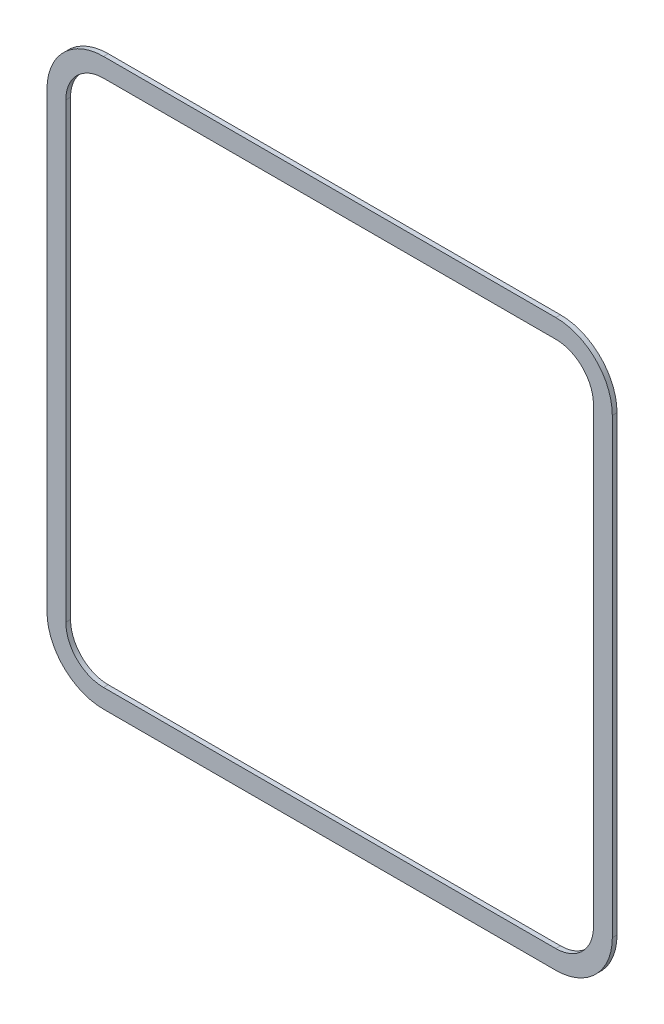
ISO-10303-21;
HEADER;
FILE_DESCRIPTION(('STEP AP214'),'2;1');
FILE_NAME('part.step','',(''),(''),'','','');
FILE_SCHEMA(('AUTOMOTIVE_DESIGN { 1 0 10303 214 1 1 1 1 }'));
ENDSEC;
DATA;
#1=APPLICATION_CONTEXT('core data for automotive mechanical design processes');
#2=APPLICATION_PROTOCOL_DEFINITION('international standard','automotive_design',2000,#1);
#3=PRODUCT_CONTEXT('',#1,'mechanical');
#4=PRODUCT('Part','Part','',(#3));
#5=PRODUCT_RELATED_PRODUCT_CATEGORY('part','',(#4));
#6=PRODUCT_DEFINITION_FORMATION('','',#4);
#7=PRODUCT_DEFINITION_CONTEXT('part definition',#1,'design');
#8=PRODUCT_DEFINITION('design','',#6,#7);
#9=PRODUCT_DEFINITION_SHAPE('','',#8);
#10=(LENGTH_UNIT() NAMED_UNIT(*) SI_UNIT(.MILLI.,.METRE.));
#11=(NAMED_UNIT(*) PLANE_ANGLE_UNIT() SI_UNIT($,.RADIAN.));
#12=(NAMED_UNIT(*) SI_UNIT($,.STERADIAN.) SOLID_ANGLE_UNIT());
#13=UNCERTAINTY_MEASURE_WITH_UNIT(LENGTH_MEASURE(1.E-05),#10,'distance_accuracy_value','');
#14=(GEOMETRIC_REPRESENTATION_CONTEXT(3) GLOBAL_UNCERTAINTY_ASSIGNED_CONTEXT((#13)) GLOBAL_UNIT_ASSIGNED_CONTEXT((#10,
#11,#12)) REPRESENTATION_CONTEXT('',''));
#15=CARTESIAN_POINT('',(0.,0.,0.));
#16=DIRECTION('',(0.,0.,1.));
#17=DIRECTION('',(1.,0.,0.));
#18=AXIS2_PLACEMENT_3D('',#15,#16,#17);
#19=CARTESIAN_POINT('',(28.,0.,0.5));
#20=DIRECTION('',(1.,0.,0.));
#21=DIRECTION('',(0.,0.,-1.));
#22=AXIS2_PLACEMENT_3D('',#19,#20,#21);
#23=PLANE('',#22);
#24=DIRECTION('',(0.,-1.,0.));
#25=VECTOR('',#24,1.);
#26=CARTESIAN_POINT('',(28.,0.,0.));
#27=LINE('',#26,#25);
#28=CARTESIAN_POINT('',(28.,24.,0.));
#29=VERTEX_POINT('',#28);
#30=CARTESIAN_POINT('',(28.,-24.,0.));
#31=VERTEX_POINT('',#30);
#32=EDGE_CURVE('E230',#29,#31,#27,.T.);
#33=ORIENTED_EDGE('',*,*,#32,.T.);
#34=DIRECTION('',(0.,0.,-1.));
#35=VECTOR('',#34,1.);
#36=CARTESIAN_POINT('',(28.,-24.,0.5));
#37=LINE('',#36,#35);
#38=CARTESIAN_POINT('',(28.,-24.,0.5));
#39=VERTEX_POINT('',#38);
#40=EDGE_CURVE('E11',#39,#31,#37,.T.);
#41=ORIENTED_EDGE('',*,*,#40,.F.);
#42=DIRECTION('',(0.,-1.,0.));
#43=VECTOR('',#42,1.);
#44=CARTESIAN_POINT('',(28.,0.,0.5));
#45=LINE('',#44,#43);
#46=CARTESIAN_POINT('',(28.,24.,0.5));
#47=VERTEX_POINT('',#46);
#48=EDGE_CURVE('E338',#47,#39,#45,.T.);
#49=ORIENTED_EDGE('',*,*,#48,.F.);
#50=DIRECTION('',(0.,0.,-1.));
#51=VECTOR('',#50,1.);
#52=CARTESIAN_POINT('',(28.,24.,0.5));
#53=LINE('',#52,#51);
#54=EDGE_CURVE('E257',#47,#29,#53,.T.);
#55=ORIENTED_EDGE('',*,*,#54,.T.);
#56=EDGE_LOOP('',(#33,#41,#49,#55));
#57=FACE_BOUND('',#56,.T.);
#58=ADVANCED_FACE('F45',(#57),#23,.F.);
#59=CARTESIAN_POINT('',(24.,-24.,0.5));
#60=DIRECTION('',(0.,0.,-1.));
#61=DIRECTION('',(-1.,0.,0.));
#62=AXIS2_PLACEMENT_3D('',#59,#60,#61);
#63=CYLINDRICAL_SURFACE('',#62,3.99999999999999);
#64=CARTESIAN_POINT('',(24.,-24.,0.));
#65=DIRECTION('',(0.,0.,1.));
#66=DIRECTION('',(1.,0.,0.));
#67=AXIS2_PLACEMENT_3D('',#64,#65,#66);
#68=CIRCLE('',#67,3.99999999999999);
#69=CARTESIAN_POINT('',(24.,-28.,0.));
#70=VERTEX_POINT('',#69);
#71=EDGE_CURVE('E234',#31,#70,#68,.F.);
#72=ORIENTED_EDGE('',*,*,#71,.T.);
#73=DIRECTION('',(0.,0.,-1.));
#74=VECTOR('',#73,1.);
#75=CARTESIAN_POINT('',(24.,-28.,0.5));
#76=LINE('',#75,#74);
#77=CARTESIAN_POINT('',(24.,-28.,0.5));
#78=VERTEX_POINT('',#77);
#79=EDGE_CURVE('E56',#78,#70,#76,.T.);
#80=ORIENTED_EDGE('',*,*,#79,.F.);
#81=CARTESIAN_POINT('',(24.,-24.,0.5));
#82=DIRECTION('',(0.,0.,1.));
#83=DIRECTION('',(1.,0.,0.));
#84=AXIS2_PLACEMENT_3D('',#81,#82,#83);
#85=CIRCLE('',#84,3.99999999999999);
#86=EDGE_CURVE('E341',#39,#78,#85,.F.);
#87=ORIENTED_EDGE('',*,*,#86,.F.);
#88=ORIENTED_EDGE('',*,*,#40,.T.);
#89=EDGE_LOOP('',(#72,#80,#87,#88));
#90=FACE_BOUND('',#89,.T.);
#91=ADVANCED_FACE('F376',(#90),#63,.F.);
#92=CARTESIAN_POINT('',(0.,-28.,0.5));
#93=DIRECTION('',(0.,1.,0.));
#94=DIRECTION('',(-1.,0.,0.));
#95=AXIS2_PLACEMENT_3D('',#92,#93,#94);
#96=PLANE('',#95);
#97=DIRECTION('',(1.,0.,0.));
#98=VECTOR('',#97,1.);
#99=CARTESIAN_POINT('',(0.,-28.,0.));
#100=LINE('',#99,#98);
#101=CARTESIAN_POINT('',(-24.,-28.,0.));
#102=VERTEX_POINT('',#101);
#103=EDGE_CURVE('E238',#102,#70,#100,.T.);
#104=ORIENTED_EDGE('',*,*,#103,.F.);
#105=DIRECTION('',(0.,0.,-1.));
#106=VECTOR('',#105,1.);
#107=CARTESIAN_POINT('',(-24.,-28.,0.5));
#108=LINE('',#107,#106);
#109=CARTESIAN_POINT('',(-24.,-28.,0.5));
#110=VERTEX_POINT('',#109);
#111=EDGE_CURVE('E267',#110,#102,#108,.T.);
#112=ORIENTED_EDGE('',*,*,#111,.F.);
#113=DIRECTION('',(1.,0.,0.));
#114=VECTOR('',#113,1.);
#115=CARTESIAN_POINT('',(0.,-28.,0.5));
#116=LINE('',#115,#114);
#117=EDGE_CURVE('E344',#110,#78,#116,.T.);
#118=ORIENTED_EDGE('',*,*,#117,.T.);
#119=ORIENTED_EDGE('',*,*,#79,.T.);
#120=EDGE_LOOP('',(#104,#112,#118,#119));
#121=FACE_BOUND('',#120,.T.);
#122=ADVANCED_FACE('F381',(#121),#96,.T.);
#123=CARTESIAN_POINT('',(-24.,-24.,0.5));
#124=DIRECTION('',(0.,0.,-1.));
#125=DIRECTION('',(-1.,0.,0.));
#126=AXIS2_PLACEMENT_3D('',#123,#124,#125);
#127=CYLINDRICAL_SURFACE('',#126,4.);
#128=CARTESIAN_POINT('',(-24.,-24.,0.));
#129=DIRECTION('',(0.,0.,1.));
#130=DIRECTION('',(1.,0.,0.));
#131=AXIS2_PLACEMENT_3D('',#128,#129,#130);
#132=CIRCLE('',#131,4.);
#133=CARTESIAN_POINT('',(-28.,-24.,0.));
#134=VERTEX_POINT('',#133);
#135=EDGE_CURVE('E242',#134,#102,#132,.T.);
#136=ORIENTED_EDGE('',*,*,#135,.F.);
#137=DIRECTION('',(0.,0.,-1.));
#138=VECTOR('',#137,1.);
#139=CARTESIAN_POINT('',(-28.,-24.,0.5));
#140=LINE('',#139,#138);
#141=CARTESIAN_POINT('',(-28.,-24.,0.5));
#142=VERTEX_POINT('',#141);
#143=EDGE_CURVE('E264',#142,#134,#140,.T.);
#144=ORIENTED_EDGE('',*,*,#143,.F.);
#145=CARTESIAN_POINT('',(-24.,-24.,0.5));
#146=DIRECTION('',(0.,0.,1.));
#147=DIRECTION('',(1.,0.,0.));
#148=AXIS2_PLACEMENT_3D('',#145,#146,#147);
#149=CIRCLE('',#148,4.);
#150=EDGE_CURVE('E194',#142,#110,#149,.T.);
#151=ORIENTED_EDGE('',*,*,#150,.T.);
#152=ORIENTED_EDGE('',*,*,#111,.T.);
#153=EDGE_LOOP('',(#136,#144,#151,#152));
#154=FACE_BOUND('',#153,.T.);
#155=ADVANCED_FACE('F351',(#154),#127,.F.);
#156=CARTESIAN_POINT('',(-28.,0.,0.5));
#157=DIRECTION('',(1.,0.,0.));
#158=DIRECTION('',(0.,0.,-1.));
#159=AXIS2_PLACEMENT_3D('',#156,#157,#158);
#160=PLANE('',#159);
#161=DIRECTION('',(0.,-1.,0.));
#162=VECTOR('',#161,1.);
#163=CARTESIAN_POINT('',(-28.,0.,0.));
#164=LINE('',#163,#162);
#165=CARTESIAN_POINT('',(-28.,24.,0.));
#166=VERTEX_POINT('',#165);
#167=EDGE_CURVE('E246',#166,#134,#164,.T.);
#168=ORIENTED_EDGE('',*,*,#167,.F.);
#169=DIRECTION('',(0.,0.,-1.));
#170=VECTOR('',#169,1.);
#171=CARTESIAN_POINT('',(-28.,24.,0.5));
#172=LINE('',#171,#170);
#173=CARTESIAN_POINT('',(-28.,24.,0.5));
#174=VERTEX_POINT('',#173);
#175=EDGE_CURVE('E179',#174,#166,#172,.T.);
#176=ORIENTED_EDGE('',*,*,#175,.F.);
#177=DIRECTION('',(0.,-1.,0.));
#178=VECTOR('',#177,1.);
#179=CARTESIAN_POINT('',(-28.,0.,0.5));
#180=LINE('',#179,#178);
#181=EDGE_CURVE('E190',#174,#142,#180,.T.);
#182=ORIENTED_EDGE('',*,*,#181,.T.);
#183=ORIENTED_EDGE('',*,*,#143,.T.);
#184=EDGE_LOOP('',(#168,#176,#182,#183));
#185=FACE_BOUND('',#184,.T.);
#186=ADVANCED_FACE('F356',(#185),#160,.T.);
#187=CARTESIAN_POINT('',(-24.,24.,0.5));
#188=DIRECTION('',(0.,0.,-1.));
#189=DIRECTION('',(-1.,0.,0.));
#190=AXIS2_PLACEMENT_3D('',#187,#188,#189);
#191=CYLINDRICAL_SURFACE('',#190,4.);
#192=CARTESIAN_POINT('',(-24.,24.,0.));
#193=DIRECTION('',(0.,0.,1.));
#194=DIRECTION('',(1.,0.,0.));
#195=AXIS2_PLACEMENT_3D('',#192,#193,#194);
#196=CIRCLE('',#195,4.);
#197=CARTESIAN_POINT('',(-24.,28.,0.));
#198=VERTEX_POINT('',#197);
#199=EDGE_CURVE('E177',#198,#166,#196,.T.);
#200=ORIENTED_EDGE('',*,*,#199,.F.);
#201=DIRECTION('',(0.,0.,-1.));
#202=VECTOR('',#201,1.);
#203=CARTESIAN_POINT('',(-24.,28.,0.5));
#204=LINE('',#203,#202);
#205=CARTESIAN_POINT('',(-24.,28.,0.5));
#206=VERTEX_POINT('',#205);
#207=EDGE_CURVE('E171',#206,#198,#204,.T.);
#208=ORIENTED_EDGE('',*,*,#207,.F.);
#209=CARTESIAN_POINT('',(-24.,24.,0.5));
#210=DIRECTION('',(0.,0.,1.));
#211=DIRECTION('',(1.,0.,0.));
#212=AXIS2_PLACEMENT_3D('',#209,#210,#211);
#213=CIRCLE('',#212,4.);
#214=EDGE_CURVE('E175',#206,#174,#213,.T.);
#215=ORIENTED_EDGE('',*,*,#214,.T.);
#216=ORIENTED_EDGE('',*,*,#175,.T.);
#217=EDGE_LOOP('',(#200,#208,#215,#216));
#218=FACE_BOUND('',#217,.T.);
#219=ADVANCED_FACE('F173',(#218),#191,.F.);
#220=CARTESIAN_POINT('',(0.,28.,0.5));
#221=DIRECTION('',(0.,1.,0.));
#222=DIRECTION('',(-1.,0.,0.));
#223=AXIS2_PLACEMENT_3D('',#220,#221,#222);
#224=PLANE('',#223);
#225=DIRECTION('',(1.,0.,0.));
#226=VECTOR('',#225,1.);
#227=CARTESIAN_POINT('',(0.,28.,0.));
#228=LINE('',#227,#226);
#229=CARTESIAN_POINT('',(24.,28.,0.));
#230=VERTEX_POINT('',#229);
#231=EDGE_CURVE('E117',#198,#230,#228,.T.);
#232=ORIENTED_EDGE('',*,*,#231,.T.);
#233=DIRECTION('',(0.,0.,-1.));
#234=VECTOR('',#233,1.);
#235=CARTESIAN_POINT('',(24.,28.,0.5));
#236=LINE('',#235,#234);
#237=CARTESIAN_POINT('',(24.,28.,0.5));
#238=VERTEX_POINT('',#237);
#239=EDGE_CURVE('E180',#238,#230,#236,.T.);
#240=ORIENTED_EDGE('',*,*,#239,.F.);
#241=DIRECTION('',(1.,0.,0.));
#242=VECTOR('',#241,1.);
#243=CARTESIAN_POINT('',(0.,28.,0.5));
#244=LINE('',#243,#242);
#245=EDGE_CURVE('E182',#206,#238,#244,.T.);
#246=ORIENTED_EDGE('',*,*,#245,.F.);
#247=ORIENTED_EDGE('',*,*,#207,.T.);
#248=EDGE_LOOP('',(#232,#240,#246,#247));
#249=FACE_BOUND('',#248,.T.);
#250=ADVANCED_FACE('F183',(#249),#224,.F.);
#251=CARTESIAN_POINT('',(24.,-24.,0.5));
#252=DIRECTION('',(0.,0.,-1.));
#253=DIRECTION('',(-1.,0.,0.));
#254=AXIS2_PLACEMENT_3D('',#251,#252,#253);
#255=CYLINDRICAL_SURFACE('',#254,5.99999999999998);
#256=CARTESIAN_POINT('',(24.,-24.,0.));
#257=DIRECTION('',(0.,0.,1.));
#258=DIRECTION('',(1.,0.,0.));
#259=AXIS2_PLACEMENT_3D('',#256,#257,#258);
#260=CIRCLE('',#259,5.99999999999998);
#261=CARTESIAN_POINT('',(30.,-24.,0.));
#262=VERTEX_POINT('',#261);
#263=CARTESIAN_POINT('',(24.,-30.,0.));
#264=VERTEX_POINT('',#263);
#265=EDGE_CURVE('E201',#262,#264,#260,.F.);
#266=ORIENTED_EDGE('',*,*,#265,.F.);
#267=DIRECTION('',(0.,0.,-1.));
#268=VECTOR('',#267,1.);
#269=CARTESIAN_POINT('',(30.,-24.,0.5));
#270=LINE('',#269,#268);
#271=CARTESIAN_POINT('',(30.,-24.,0.5));
#272=VERTEX_POINT('',#271);
#273=EDGE_CURVE('E49',#272,#262,#270,.T.);
#274=ORIENTED_EDGE('',*,*,#273,.F.);
#275=CARTESIAN_POINT('',(24.,-24.,0.5));
#276=DIRECTION('',(0.,0.,1.));
#277=DIRECTION('',(1.,0.,0.));
#278=AXIS2_PLACEMENT_3D('',#275,#276,#277);
#279=CIRCLE('',#278,5.99999999999998);
#280=CARTESIAN_POINT('',(24.,-30.,0.5));
#281=VERTEX_POINT('',#280);
#282=EDGE_CURVE('E256',#272,#281,#279,.F.);
#283=ORIENTED_EDGE('',*,*,#282,.T.);
#284=DIRECTION('',(0.,0.,-1.));
#285=VECTOR('',#284,1.);
#286=CARTESIAN_POINT('',(24.,-30.,0.5));
#287=LINE('',#286,#285);
#288=EDGE_CURVE('E200',#281,#264,#287,.T.);
#289=ORIENTED_EDGE('',*,*,#288,.T.);
#290=EDGE_LOOP('',(#266,#274,#283,#289));
#291=FACE_BOUND('',#290,.T.);
#292=ADVANCED_FACE('F47',(#291),#255,.T.);
#293=CARTESIAN_POINT('',(30.,0.,0.5));
#294=DIRECTION('',(1.,0.,0.));
#295=DIRECTION('',(0.,1.,0.));
#296=AXIS2_PLACEMENT_3D('',#293,#294,#295);
#297=PLANE('',#296);
#298=DIRECTION('',(0.,-1.,0.));
#299=VECTOR('',#298,1.);
#300=CARTESIAN_POINT('',(30.,0.,0.));
#301=LINE('',#300,#299);
#302=CARTESIAN_POINT('',(30.,24.,0.));
#303=VERTEX_POINT('',#302);
#304=EDGE_CURVE('E205',#303,#262,#301,.T.);
#305=ORIENTED_EDGE('',*,*,#304,.F.);
#306=DIRECTION('',(0.,0.,-1.));
#307=VECTOR('',#306,1.);
#308=CARTESIAN_POINT('',(30.,24.,0.5));
#309=LINE('',#308,#307);
#310=CARTESIAN_POINT('',(30.,24.,0.5));
#311=VERTEX_POINT('',#310);
#312=EDGE_CURVE('E291',#311,#303,#309,.T.);
#313=ORIENTED_EDGE('',*,*,#312,.F.);
#314=DIRECTION('',(0.,-1.,0.));
#315=VECTOR('',#314,1.);
#316=CARTESIAN_POINT('',(30.,0.,0.5));
#317=LINE('',#316,#315);
#318=EDGE_CURVE('E302',#311,#272,#317,.T.);
#319=ORIENTED_EDGE('',*,*,#318,.T.);
#320=ORIENTED_EDGE('',*,*,#273,.T.);
#321=EDGE_LOOP('',(#305,#313,#319,#320));
#322=FACE_BOUND('',#321,.T.);
#323=ADVANCED_FACE('F300',(#322),#297,.T.);
#324=CARTESIAN_POINT('',(24.,24.,0.5));
#325=DIRECTION('',(0.,0.,-1.));
#326=DIRECTION('',(-1.,0.,0.));
#327=AXIS2_PLACEMENT_3D('',#324,#325,#326);
#328=CYLINDRICAL_SURFACE('',#327,6.);
#329=CARTESIAN_POINT('',(24.,24.,0.));
#330=DIRECTION('',(0.,0.,1.));
#331=DIRECTION('',(1.,0.,0.));
#332=AXIS2_PLACEMENT_3D('',#329,#330,#331);
#333=CIRCLE('',#332,6.);
#334=CARTESIAN_POINT('',(24.,30.,0.));
#335=VERTEX_POINT('',#334);
#336=EDGE_CURVE('E209',#335,#303,#333,.F.);
#337=ORIENTED_EDGE('',*,*,#336,.F.);
#338=DIRECTION('',(0.,0.,-1.));
#339=VECTOR('',#338,1.);
#340=CARTESIAN_POINT('',(24.,30.,0.5));
#341=LINE('',#340,#339);
#342=CARTESIAN_POINT('',(24.,30.,0.5));
#343=VERTEX_POINT('',#342);
#344=EDGE_CURVE('E289',#343,#335,#341,.T.);
#345=ORIENTED_EDGE('',*,*,#344,.F.);
#346=CARTESIAN_POINT('',(24.,24.,0.5));
#347=DIRECTION('',(0.,0.,1.));
#348=DIRECTION('',(1.,0.,0.));
#349=AXIS2_PLACEMENT_3D('',#346,#347,#348);
#350=CIRCLE('',#349,6.);
#351=EDGE_CURVE('E312',#343,#311,#350,.F.);
#352=ORIENTED_EDGE('',*,*,#351,.T.);
#353=ORIENTED_EDGE('',*,*,#312,.T.);
#354=EDGE_LOOP('',(#337,#345,#352,#353));
#355=FACE_BOUND('',#354,.T.);
#356=ADVANCED_FACE('F310',(#355),#328,.T.);
#357=CARTESIAN_POINT('',(0.,30.,0.5));
#358=DIRECTION('',(0.,1.,0.));
#359=DIRECTION('',(-1.,0.,0.));
#360=AXIS2_PLACEMENT_3D('',#357,#358,#359);
#361=PLANE('',#360);
#362=DIRECTION('',(1.,0.,0.));
#363=VECTOR('',#362,1.);
#364=CARTESIAN_POINT('',(0.,30.,0.));
#365=LINE('',#364,#363);
#366=CARTESIAN_POINT('',(-24.,30.,0.));
#367=VERTEX_POINT('',#366);
#368=EDGE_CURVE('E213',#367,#335,#365,.T.);
#369=ORIENTED_EDGE('',*,*,#368,.F.);
#370=DIRECTION('',(0.,0.,-1.));
#371=VECTOR('',#370,1.);
#372=CARTESIAN_POINT('',(-24.,30.,0.5));
#373=LINE('',#372,#371);
#374=CARTESIAN_POINT('',(-24.,30.,0.5));
#375=VERTEX_POINT('',#374);
#376=EDGE_CURVE('E286',#375,#367,#373,.T.);
#377=ORIENTED_EDGE('',*,*,#376,.F.);
#378=DIRECTION('',(1.,0.,0.));
#379=VECTOR('',#378,1.);
#380=CARTESIAN_POINT('',(0.,30.,0.5));
#381=LINE('',#380,#379);
#382=EDGE_CURVE('E317',#375,#343,#381,.T.);
#383=ORIENTED_EDGE('',*,*,#382,.T.);
#384=ORIENTED_EDGE('',*,*,#344,.T.);
#385=EDGE_LOOP('',(#369,#377,#383,#384));
#386=FACE_BOUND('',#385,.T.);
#387=ADVANCED_FACE('F320',(#386),#361,.T.);
#388=CARTESIAN_POINT('',(-24.,24.,0.5));
#389=DIRECTION('',(0.,0.,-1.));
#390=DIRECTION('',(-1.,0.,0.));
#391=AXIS2_PLACEMENT_3D('',#388,#389,#390);
#392=CYLINDRICAL_SURFACE('',#391,6.);
#393=CARTESIAN_POINT('',(-24.,24.,0.));
#394=DIRECTION('',(0.,0.,1.));
#395=DIRECTION('',(1.,0.,0.));
#396=AXIS2_PLACEMENT_3D('',#393,#394,#395);
#397=CIRCLE('',#396,6.);
#398=CARTESIAN_POINT('',(-30.,24.,0.));
#399=VERTEX_POINT('',#398);
#400=EDGE_CURVE('E217',#367,#399,#397,.T.);
#401=ORIENTED_EDGE('',*,*,#400,.T.);
#402=DIRECTION('',(0.,0.,-1.));
#403=VECTOR('',#402,1.);
#404=CARTESIAN_POINT('',(-30.,24.,0.5));
#405=LINE('',#404,#403);
#406=CARTESIAN_POINT('',(-30.,24.,0.5));
#407=VERTEX_POINT('',#406);
#408=EDGE_CURVE('E282',#407,#399,#405,.T.);
#409=ORIENTED_EDGE('',*,*,#408,.F.);
#410=CARTESIAN_POINT('',(-24.,24.,0.5));
#411=DIRECTION('',(0.,0.,1.));
#412=DIRECTION('',(1.,0.,0.));
#413=AXIS2_PLACEMENT_3D('',#410,#411,#412);
#414=CIRCLE('',#413,6.);
#415=EDGE_CURVE('E323',#375,#407,#414,.T.);
#416=ORIENTED_EDGE('',*,*,#415,.F.);
#417=ORIENTED_EDGE('',*,*,#376,.T.);
#418=EDGE_LOOP('',(#401,#409,#416,#417));
#419=FACE_BOUND('',#418,.T.);
#420=ADVANCED_FACE('F392',(#419),#392,.T.);
#421=CARTESIAN_POINT('',(-30.,0.,0.5));
#422=DIRECTION('',(1.,0.,0.));
#423=DIRECTION('',(0.,1.,0.));
#424=AXIS2_PLACEMENT_3D('',#421,#422,#423);
#425=PLANE('',#424);
#426=DIRECTION('',(0.,-1.,0.));
#427=VECTOR('',#426,1.);
#428=CARTESIAN_POINT('',(-30.,0.,0.));
#429=LINE('',#428,#427);
#430=CARTESIAN_POINT('',(-30.,-24.,0.));
#431=VERTEX_POINT('',#430);
#432=EDGE_CURVE('E220',#399,#431,#429,.T.);
#433=ORIENTED_EDGE('',*,*,#432,.T.);
#434=DIRECTION('',(0.,0.,-1.));
#435=VECTOR('',#434,1.);
#436=CARTESIAN_POINT('',(-30.,-24.,0.5));
#437=LINE('',#436,#435);
#438=CARTESIAN_POINT('',(-30.,-24.,0.5));
#439=VERTEX_POINT('',#438);
#440=EDGE_CURVE('E278',#439,#431,#437,.T.);
#441=ORIENTED_EDGE('',*,*,#440,.F.);
#442=DIRECTION('',(0.,-1.,0.));
#443=VECTOR('',#442,1.);
#444=CARTESIAN_POINT('',(-30.,0.,0.5));
#445=LINE('',#444,#443);
#446=EDGE_CURVE('E326',#407,#439,#445,.T.);
#447=ORIENTED_EDGE('',*,*,#446,.F.);
#448=ORIENTED_EDGE('',*,*,#408,.T.);
#449=EDGE_LOOP('',(#433,#441,#447,#448));
#450=FACE_BOUND('',#449,.T.);
#451=ADVANCED_FACE('F388',(#450),#425,.F.);
#452=CARTESIAN_POINT('',(-24.,-24.,0.5));
#453=DIRECTION('',(0.,0.,-1.));
#454=DIRECTION('',(-1.,0.,0.));
#455=AXIS2_PLACEMENT_3D('',#452,#453,#454);
#456=CYLINDRICAL_SURFACE('',#455,6.);
#457=CARTESIAN_POINT('',(-24.,-24.,0.));
#458=DIRECTION('',(0.,0.,1.));
#459=DIRECTION('',(1.,0.,0.));
#460=AXIS2_PLACEMENT_3D('',#457,#458,#459);
#461=CIRCLE('',#460,6.);
#462=CARTESIAN_POINT('',(-24.,-30.,0.));
#463=VERTEX_POINT('',#462);
#464=EDGE_CURVE('E223',#431,#463,#461,.T.);
#465=ORIENTED_EDGE('',*,*,#464,.T.);
#466=DIRECTION('',(0.,0.,-1.));
#467=VECTOR('',#466,1.);
#468=CARTESIAN_POINT('',(-24.,-30.,0.5));
#469=LINE('',#468,#467);
#470=CARTESIAN_POINT('',(-24.,-30.,0.5));
#471=VERTEX_POINT('',#470);
#472=EDGE_CURVE('E274',#471,#463,#469,.T.);
#473=ORIENTED_EDGE('',*,*,#472,.F.);
#474=CARTESIAN_POINT('',(-24.,-24.,0.5));
#475=DIRECTION('',(0.,0.,1.));
#476=DIRECTION('',(1.,0.,0.));
#477=AXIS2_PLACEMENT_3D('',#474,#475,#476);
#478=CIRCLE('',#477,6.);
#479=EDGE_CURVE('E332',#439,#471,#478,.T.);
#480=ORIENTED_EDGE('',*,*,#479,.F.);
#481=ORIENTED_EDGE('',*,*,#440,.T.);
#482=EDGE_LOOP('',(#465,#473,#480,#481));
#483=FACE_BOUND('',#482,.T.);
#484=ADVANCED_FACE('F370',(#483),#456,.T.);
#485=CARTESIAN_POINT('',(0.,-30.,0.5));
#486=DIRECTION('',(0.,1.,0.));
#487=DIRECTION('',(-1.,0.,0.));
#488=AXIS2_PLACEMENT_3D('',#485,#486,#487);
#489=PLANE('',#488);
#490=DIRECTION('',(1.,0.,0.));
#491=VECTOR('',#490,1.);
#492=CARTESIAN_POINT('',(0.,-30.,0.));
#493=LINE('',#492,#491);
#494=EDGE_CURVE('E226',#463,#264,#493,.T.);
#495=ORIENTED_EDGE('',*,*,#494,.T.);
#496=ORIENTED_EDGE('',*,*,#288,.F.);
#497=DIRECTION('',(1.,0.,0.));
#498=VECTOR('',#497,1.);
#499=CARTESIAN_POINT('',(0.,-30.,0.5));
#500=LINE('',#499,#498);
#501=EDGE_CURVE('E335',#471,#281,#500,.T.);
#502=ORIENTED_EDGE('',*,*,#501,.F.);
#503=ORIENTED_EDGE('',*,*,#472,.T.);
#504=EDGE_LOOP('',(#495,#496,#502,#503));
#505=FACE_BOUND('',#504,.T.);
#506=ADVANCED_FACE('F363',(#505),#489,.F.);
#507=CARTESIAN_POINT('',(24.,24.,0.5));
#508=DIRECTION('',(0.,0.,-1.));
#509=DIRECTION('',(-1.,0.,0.));
#510=AXIS2_PLACEMENT_3D('',#507,#508,#509);
#511=CYLINDRICAL_SURFACE('',#510,4.);
#512=CARTESIAN_POINT('',(24.,24.,0.));
#513=DIRECTION('',(0.,0.,1.));
#514=DIRECTION('',(1.,0.,0.));
#515=AXIS2_PLACEMENT_3D('',#512,#513,#514);
#516=CIRCLE('',#515,4.);
#517=EDGE_CURVE('E123',#230,#29,#516,.F.);
#518=ORIENTED_EDGE('',*,*,#517,.T.);
#519=ORIENTED_EDGE('',*,*,#54,.F.);
#520=CARTESIAN_POINT('',(24.,24.,0.5));
#521=DIRECTION('',(0.,0.,1.));
#522=DIRECTION('',(1.,0.,0.));
#523=AXIS2_PLACEMENT_3D('',#520,#521,#522);
#524=CIRCLE('',#523,4.);
#525=EDGE_CURVE('E65',#238,#47,#524,.F.);
#526=ORIENTED_EDGE('',*,*,#525,.F.);
#527=ORIENTED_EDGE('',*,*,#239,.T.);
#528=EDGE_LOOP('',(#518,#519,#526,#527));
#529=FACE_BOUND('',#528,.T.);
#530=ADVANCED_FACE('F361',(#529),#511,.F.);
#531=CARTESIAN_POINT('',(0.,0.,0.5));
#532=DIRECTION('',(0.,0.,1.));
#533=DIRECTION('',(1.,0.,0.));
#534=AXIS2_PLACEMENT_3D('',#531,#532,#533);
#535=PLANE('',#534);
#536=ORIENTED_EDGE('',*,*,#282,.F.);
#537=ORIENTED_EDGE('',*,*,#318,.F.);
#538=ORIENTED_EDGE('',*,*,#351,.F.);
#539=ORIENTED_EDGE('',*,*,#382,.F.);
#540=ORIENTED_EDGE('',*,*,#415,.T.);
#541=ORIENTED_EDGE('',*,*,#446,.T.);
#542=ORIENTED_EDGE('',*,*,#479,.T.);
#543=ORIENTED_EDGE('',*,*,#501,.T.);
#544=EDGE_LOOP('',(#536,#537,#538,#539,#540,#541,#542,#543));
#545=FACE_BOUND('',#544,.T.);
#546=ORIENTED_EDGE('',*,*,#48,.T.);
#547=ORIENTED_EDGE('',*,*,#86,.T.);
#548=ORIENTED_EDGE('',*,*,#117,.F.);
#549=ORIENTED_EDGE('',*,*,#150,.F.);
#550=ORIENTED_EDGE('',*,*,#181,.F.);
#551=ORIENTED_EDGE('',*,*,#214,.F.);
#552=ORIENTED_EDGE('',*,*,#245,.T.);
#553=ORIENTED_EDGE('',*,*,#525,.T.);
#554=EDGE_LOOP('',(#546,#547,#548,#549,#550,#551,#552,#553));
#555=FACE_BOUND('',#554,.T.);
#556=ADVANCED_FACE('F187',(#545,#555),#535,.T.);
#557=CARTESIAN_POINT('',(0.,0.,0.));
#558=DIRECTION('',(0.,0.,1.));
#559=DIRECTION('',(1.,0.,0.));
#560=AXIS2_PLACEMENT_3D('',#557,#558,#559);
#561=PLANE('',#560);
#562=ORIENTED_EDGE('',*,*,#265,.T.);
#563=ORIENTED_EDGE('',*,*,#494,.F.);
#564=ORIENTED_EDGE('',*,*,#464,.F.);
#565=ORIENTED_EDGE('',*,*,#432,.F.);
#566=ORIENTED_EDGE('',*,*,#400,.F.);
#567=ORIENTED_EDGE('',*,*,#368,.T.);
#568=ORIENTED_EDGE('',*,*,#336,.T.);
#569=ORIENTED_EDGE('',*,*,#304,.T.);
#570=EDGE_LOOP('',(#562,#563,#564,#565,#566,#567,#568,#569));
#571=FACE_BOUND('',#570,.T.);
#572=ORIENTED_EDGE('',*,*,#32,.F.);
#573=ORIENTED_EDGE('',*,*,#517,.F.);
#574=ORIENTED_EDGE('',*,*,#231,.F.);
#575=ORIENTED_EDGE('',*,*,#199,.T.);
#576=ORIENTED_EDGE('',*,*,#167,.T.);
#577=ORIENTED_EDGE('',*,*,#135,.T.);
#578=ORIENTED_EDGE('',*,*,#103,.T.);
#579=ORIENTED_EDGE('',*,*,#71,.F.);
#580=EDGE_LOOP('',(#572,#573,#574,#575,#576,#577,#578,#579));
#581=FACE_BOUND('',#580,.T.);
#582=ADVANCED_FACE('F306',(#571,#581),#561,.F.);
#583=CLOSED_SHELL('',(#58,#91,#122,#155,#186,#219,#250,#292,#323,#356,#387,#420,#451,#484,#506,
#530,#556,#582));
#584=MANIFOLD_SOLID_BREP('B2',#583);
#585=ADVANCED_BREP_SHAPE_REPRESENTATION('',(#18,#584),#14);
#586=SHAPE_DEFINITION_REPRESENTATION(#9,#585);
ENDSEC;
END-ISO-10303-21;
